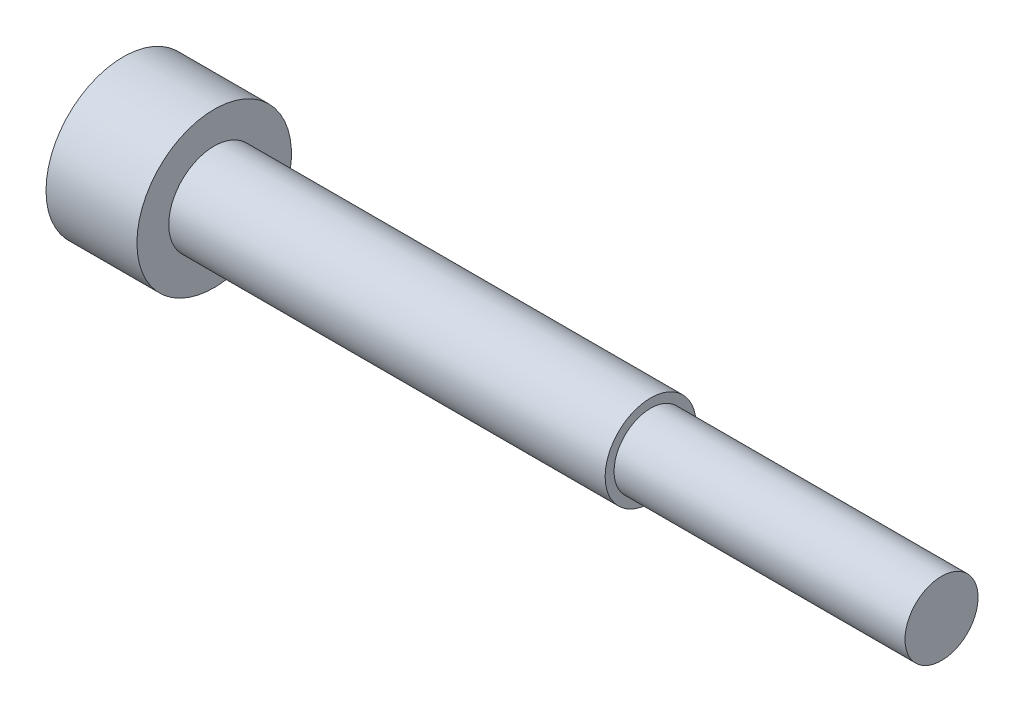
ISO-10303-21;
HEADER;
FILE_DESCRIPTION(('STEP AP214'),'2;1');
FILE_NAME('part.step','',(''),(''),'','','');
FILE_SCHEMA(('AUTOMOTIVE_DESIGN { 1 0 10303 214 1 1 1 1 }'));
ENDSEC;
DATA;
#1=APPLICATION_CONTEXT('core data for automotive mechanical design processes');
#2=APPLICATION_PROTOCOL_DEFINITION('international standard','automotive_design',2000,#1);
#3=PRODUCT_CONTEXT('',#1,'mechanical');
#4=PRODUCT('Part','Part','',(#3));
#5=PRODUCT_RELATED_PRODUCT_CATEGORY('part','',(#4));
#6=PRODUCT_DEFINITION_FORMATION('','',#4);
#7=PRODUCT_DEFINITION_CONTEXT('part definition',#1,'design');
#8=PRODUCT_DEFINITION('design','',#6,#7);
#9=PRODUCT_DEFINITION_SHAPE('','',#8);
#10=(LENGTH_UNIT() NAMED_UNIT(*) SI_UNIT(.MILLI.,.METRE.));
#11=(NAMED_UNIT(*) PLANE_ANGLE_UNIT() SI_UNIT($,.RADIAN.));
#12=(NAMED_UNIT(*) SI_UNIT($,.STERADIAN.) SOLID_ANGLE_UNIT());
#13=UNCERTAINTY_MEASURE_WITH_UNIT(LENGTH_MEASURE(1.E-05),#10,'distance_accuracy_value','');
#14=(GEOMETRIC_REPRESENTATION_CONTEXT(3) GLOBAL_UNCERTAINTY_ASSIGNED_CONTEXT((#13)) GLOBAL_UNIT_ASSIGNED_CONTEXT((#10,
#11,#12)) REPRESENTATION_CONTEXT('',''));
#15=CARTESIAN_POINT('',(0.,0.,0.));
#16=DIRECTION('',(0.,0.,1.));
#17=DIRECTION('',(1.,0.,0.));
#18=AXIS2_PLACEMENT_3D('',#15,#16,#17);
#19=CARTESIAN_POINT('',(0.,2.0095,0.));
#20=DIRECTION('',(-1.,0.,0.));
#21=DIRECTION('',(0.,0.,1.));
#22=AXIS2_PLACEMENT_3D('',#19,#20,#21);
#23=PLANE('',#22);
#24=CARTESIAN_POINT('',(0.,0.,0.));
#25=DIRECTION('',(-1.,0.,0.));
#26=DIRECTION('',(0.,0.,1.));
#27=AXIS2_PLACEMENT_3D('',#24,#25,#26);
#28=CIRCLE('',#27,4.25);
#29=CARTESIAN_POINT('',(0.,0.,4.25));
#30=VERTEX_POINT('',#29);
#31=EDGE_CURVE('E143',#30,#30,#28,.T.);
#32=ORIENTED_EDGE('',*,*,#31,.F.);
#33=EDGE_LOOP('',(#32));
#34=FACE_BOUND('',#33,.T.);
#35=CARTESIAN_POINT('',(0.,0.,0.));
#36=DIRECTION('',(-1.,0.,0.));
#37=DIRECTION('',(0.,0.,1.));
#38=AXIS2_PLACEMENT_3D('',#35,#36,#37);
#39=CIRCLE('',#38,2.5);
#40=CARTESIAN_POINT('',(0.,0.,2.5));
#41=VERTEX_POINT('',#40);
#42=EDGE_CURVE('E39',#41,#41,#39,.F.);
#43=ORIENTED_EDGE('',*,*,#42,.F.);
#44=EDGE_LOOP('',(#43));
#45=FACE_BOUND('',#44,.T.);
#46=ADVANCED_FACE('F31',(#34,#45),#23,.F.);
#47=CARTESIAN_POINT('',(0.,0.,0.));
#48=DIRECTION('',(-1.,0.,0.));
#49=DIRECTION('',(0.,0.,1.));
#50=AXIS2_PLACEMENT_3D('',#47,#48,#49);
#51=CYLINDRICAL_SURFACE('',#50,4.25);
#52=CARTESIAN_POINT('',(-5.,0.,0.));
#53=DIRECTION('',(-1.,0.,0.));
#54=DIRECTION('',(0.,0.,1.));
#55=AXIS2_PLACEMENT_3D('',#52,#53,#54);
#56=CIRCLE('',#55,4.25);
#57=CARTESIAN_POINT('',(-5.,0.,4.25));
#58=VERTEX_POINT('',#57);
#59=EDGE_CURVE('E134',#58,#58,#56,.T.);
#60=ORIENTED_EDGE('',*,*,#59,.F.);
#61=EDGE_LOOP('',(#60));
#62=FACE_BOUND('',#61,.T.);
#63=ORIENTED_EDGE('',*,*,#31,.T.);
#64=EDGE_LOOP('',(#63));
#65=FACE_BOUND('',#64,.T.);
#66=ADVANCED_FACE('F154',(#62,#65),#51,.T.);
#67=CARTESIAN_POINT('',(-5.,4.25,0.));
#68=DIRECTION('',(1.,0.,0.));
#69=DIRECTION('',(0.,0.,-1.));
#70=AXIS2_PLACEMENT_3D('',#67,#68,#69);
#71=PLANE('',#70);
#72=DIRECTION('',(0.,0.866025403784439,-0.5));
#73=VECTOR('',#72,1.);
#74=CARTESIAN_POINT('',(-5.,0.,2.3094010767585));
#75=LINE('',#74,#73);
#76=CARTESIAN_POINT('',(-5.,0.,2.3094010767585));
#77=VERTEX_POINT('',#76);
#78=CARTESIAN_POINT('',(-5.,2.,1.15470053837925));
#79=VERTEX_POINT('',#78);
#80=EDGE_CURVE('E100',#77,#79,#75,.T.);
#81=ORIENTED_EDGE('',*,*,#80,.F.);
#82=DIRECTION('',(0.,0.866025403784439,0.5));
#83=VECTOR('',#82,1.);
#84=CARTESIAN_POINT('',(-5.,-2.,1.15470053837925));
#85=LINE('',#84,#83);
#86=CARTESIAN_POINT('',(-5.,-2.,1.15470053837925));
#87=VERTEX_POINT('',#86);
#88=EDGE_CURVE('E46',#87,#77,#85,.T.);
#89=ORIENTED_EDGE('',*,*,#88,.F.);
#90=DIRECTION('',(0.,0.,1.));
#91=VECTOR('',#90,1.);
#92=CARTESIAN_POINT('',(-5.,-2.,-1.15470053837925));
#93=LINE('',#92,#91);
#94=CARTESIAN_POINT('',(-5.,-2.,-1.15470053837925));
#95=VERTEX_POINT('',#94);
#96=EDGE_CURVE('E116',#95,#87,#93,.T.);
#97=ORIENTED_EDGE('',*,*,#96,.F.);
#98=DIRECTION('',(0.,-0.866025403784439,0.5));
#99=VECTOR('',#98,1.);
#100=CARTESIAN_POINT('',(-5.,0.,-2.3094010767585));
#101=LINE('',#100,#99);
#102=CARTESIAN_POINT('',(-5.,0.,-2.3094010767585));
#103=VERTEX_POINT('',#102);
#104=EDGE_CURVE('E110',#103,#95,#101,.T.);
#105=ORIENTED_EDGE('',*,*,#104,.F.);
#106=DIRECTION('',(0.,-0.866025403784439,-0.5));
#107=VECTOR('',#106,1.);
#108=CARTESIAN_POINT('',(-5.,2.,-1.15470053837925));
#109=LINE('',#108,#107);
#110=CARTESIAN_POINT('',(-5.,2.,-1.15470053837925));
#111=VERTEX_POINT('',#110);
#112=EDGE_CURVE('E108',#111,#103,#109,.T.);
#113=ORIENTED_EDGE('',*,*,#112,.F.);
#114=DIRECTION('',(0.,0.,-1.));
#115=VECTOR('',#114,1.);
#116=CARTESIAN_POINT('',(-5.,2.,1.15470053837925));
#117=LINE('',#116,#115);
#118=EDGE_CURVE('E89',#79,#111,#117,.T.);
#119=ORIENTED_EDGE('',*,*,#118,.F.);
#120=EDGE_LOOP('',(#81,#89,#97,#105,#113,#119));
#121=FACE_BOUND('',#120,.T.);
#122=ORIENTED_EDGE('',*,*,#59,.T.);
#123=EDGE_LOOP('',(#122));
#124=FACE_BOUND('',#123,.T.);
#125=ADVANCED_FACE('F104',(#121,#124),#71,.F.);
#126=CARTESIAN_POINT('',(-1.35,-2.,1.15470053837925));
#127=DIRECTION('',(0.,-0.5,0.866025403784439));
#128=DIRECTION('',(0.,-0.866025403784439,-0.5));
#129=AXIS2_PLACEMENT_3D('',#126,#127,#128);
#130=PLANE('',#129);
#131=ORIENTED_EDGE('',*,*,#88,.T.);
#132=DIRECTION('',(-1.,0.,0.));
#133=VECTOR('',#132,1.);
#134=CARTESIAN_POINT('',(-1.35,0.,2.3094010767585));
#135=LINE('',#134,#133);
#136=CARTESIAN_POINT('',(-1.35,0.,2.3094010767585));
#137=VERTEX_POINT('',#136);
#138=EDGE_CURVE('E97',#137,#77,#135,.T.);
#139=ORIENTED_EDGE('',*,*,#138,.F.);
#140=DIRECTION('',(0.,0.866025403784439,0.5));
#141=VECTOR('',#140,1.);
#142=CARTESIAN_POINT('',(-1.35,-2.,1.15470053837925));
#143=LINE('',#142,#141);
#144=CARTESIAN_POINT('',(-1.35,-2.,1.15470053837925));
#145=VERTEX_POINT('',#144);
#146=EDGE_CURVE('E118',#145,#137,#143,.T.);
#147=ORIENTED_EDGE('',*,*,#146,.F.);
#148=DIRECTION('',(-1.,0.,0.));
#149=VECTOR('',#148,1.);
#150=CARTESIAN_POINT('',(-1.35,-2.,1.15470053837925));
#151=LINE('',#150,#149);
#152=EDGE_CURVE('E53',#145,#87,#151,.T.);
#153=ORIENTED_EDGE('',*,*,#152,.T.);
#154=EDGE_LOOP('',(#131,#139,#147,#153));
#155=FACE_BOUND('',#154,.T.);
#156=ADVANCED_FACE('F194',(#155),#130,.F.);
#157=CARTESIAN_POINT('',(-1.35,-2.,-1.15470053837925));
#158=DIRECTION('',(0.,-1.,0.));
#159=DIRECTION('',(0.,0.,-1.));
#160=AXIS2_PLACEMENT_3D('',#157,#158,#159);
#161=PLANE('',#160);
#162=ORIENTED_EDGE('',*,*,#96,.T.);
#163=ORIENTED_EDGE('',*,*,#152,.F.);
#164=DIRECTION('',(0.,0.,1.));
#165=VECTOR('',#164,1.);
#166=CARTESIAN_POINT('',(-1.35,-2.,-1.15470053837925));
#167=LINE('',#166,#165);
#168=CARTESIAN_POINT('',(-1.35,-2.,-1.15470053837925));
#169=VERTEX_POINT('',#168);
#170=EDGE_CURVE('E130',#169,#145,#167,.T.);
#171=ORIENTED_EDGE('',*,*,#170,.F.);
#172=DIRECTION('',(-1.,0.,0.));
#173=VECTOR('',#172,1.);
#174=CARTESIAN_POINT('',(-1.35,-2.,-1.15470053837925));
#175=LINE('',#174,#173);
#176=EDGE_CURVE('E135',#169,#95,#175,.T.);
#177=ORIENTED_EDGE('',*,*,#176,.T.);
#178=EDGE_LOOP('',(#162,#163,#171,#177));
#179=FACE_BOUND('',#178,.T.);
#180=ADVANCED_FACE('F190',(#179),#161,.F.);
#181=CARTESIAN_POINT('',(-1.35,0.,-2.3094010767585));
#182=DIRECTION('',(0.,-0.5,-0.866025403784439));
#183=DIRECTION('',(0.,0.866025403784439,-0.5));
#184=AXIS2_PLACEMENT_3D('',#181,#182,#183);
#185=PLANE('',#184);
#186=ORIENTED_EDGE('',*,*,#104,.T.);
#187=ORIENTED_EDGE('',*,*,#176,.F.);
#188=DIRECTION('',(0.,-0.866025403784439,0.5));
#189=VECTOR('',#188,1.);
#190=CARTESIAN_POINT('',(-1.35,0.,-2.3094010767585));
#191=LINE('',#190,#189);
#192=CARTESIAN_POINT('',(-1.35,0.,-2.3094010767585));
#193=VERTEX_POINT('',#192);
#194=EDGE_CURVE('E127',#193,#169,#191,.T.);
#195=ORIENTED_EDGE('',*,*,#194,.F.);
#196=DIRECTION('',(-1.,0.,0.));
#197=VECTOR('',#196,1.);
#198=CARTESIAN_POINT('',(-1.35,0.,-2.3094010767585));
#199=LINE('',#198,#197);
#200=EDGE_CURVE('E137',#193,#103,#199,.T.);
#201=ORIENTED_EDGE('',*,*,#200,.T.);
#202=EDGE_LOOP('',(#186,#187,#195,#201));
#203=FACE_BOUND('',#202,.T.);
#204=ADVANCED_FACE('F193',(#203),#185,.F.);
#205=CARTESIAN_POINT('',(-1.35,2.,-1.15470053837925));
#206=DIRECTION('',(0.,0.5,-0.866025403784439));
#207=DIRECTION('',(0.,0.866025403784439,0.5));
#208=AXIS2_PLACEMENT_3D('',#205,#206,#207);
#209=PLANE('',#208);
#210=ORIENTED_EDGE('',*,*,#112,.T.);
#211=ORIENTED_EDGE('',*,*,#200,.F.);
#212=DIRECTION('',(0.,-0.866025403784439,-0.5));
#213=VECTOR('',#212,1.);
#214=CARTESIAN_POINT('',(-1.35,2.,-1.15470053837925));
#215=LINE('',#214,#213);
#216=CARTESIAN_POINT('',(-1.35,2.,-1.15470053837925));
#217=VERTEX_POINT('',#216);
#218=EDGE_CURVE('E124',#217,#193,#215,.T.);
#219=ORIENTED_EDGE('',*,*,#218,.F.);
#220=DIRECTION('',(-1.,0.,0.));
#221=VECTOR('',#220,1.);
#222=CARTESIAN_POINT('',(-1.35,2.,-1.15470053837925));
#223=LINE('',#222,#221);
#224=EDGE_CURVE('E96',#217,#111,#223,.T.);
#225=ORIENTED_EDGE('',*,*,#224,.T.);
#226=EDGE_LOOP('',(#210,#211,#219,#225));
#227=FACE_BOUND('',#226,.T.);
#228=ADVANCED_FACE('F197',(#227),#209,.F.);
#229=CARTESIAN_POINT('',(-1.35,2.,1.15470053837925));
#230=DIRECTION('',(0.,1.,0.));
#231=DIRECTION('',(0.,0.,1.));
#232=AXIS2_PLACEMENT_3D('',#229,#230,#231);
#233=PLANE('',#232);
#234=ORIENTED_EDGE('',*,*,#118,.T.);
#235=ORIENTED_EDGE('',*,*,#224,.F.);
#236=DIRECTION('',(0.,0.,-1.));
#237=VECTOR('',#236,1.);
#238=CARTESIAN_POINT('',(-1.35,2.,1.15470053837925));
#239=LINE('',#238,#237);
#240=CARTESIAN_POINT('',(-1.35,2.,1.15470053837925));
#241=VERTEX_POINT('',#240);
#242=EDGE_CURVE('E92',#241,#217,#239,.T.);
#243=ORIENTED_EDGE('',*,*,#242,.F.);
#244=DIRECTION('',(-1.,0.,0.));
#245=VECTOR('',#244,1.);
#246=CARTESIAN_POINT('',(-1.35,2.,1.15470053837925));
#247=LINE('',#246,#245);
#248=EDGE_CURVE('E85',#241,#79,#247,.T.);
#249=ORIENTED_EDGE('',*,*,#248,.T.);
#250=EDGE_LOOP('',(#234,#235,#243,#249));
#251=FACE_BOUND('',#250,.T.);
#252=ADVANCED_FACE('F87',(#251),#233,.F.);
#253=CARTESIAN_POINT('',(-1.35,0.,2.3094010767585));
#254=DIRECTION('',(0.,0.5,0.866025403784439));
#255=DIRECTION('',(0.,-0.866025403784439,0.5));
#256=AXIS2_PLACEMENT_3D('',#253,#254,#255);
#257=PLANE('',#256);
#258=ORIENTED_EDGE('',*,*,#80,.T.);
#259=ORIENTED_EDGE('',*,*,#248,.F.);
#260=DIRECTION('',(0.,0.866025403784439,-0.5));
#261=VECTOR('',#260,1.);
#262=CARTESIAN_POINT('',(-1.35,0.,2.3094010767585));
#263=LINE('',#262,#261);
#264=EDGE_CURVE('E121',#137,#241,#263,.T.);
#265=ORIENTED_EDGE('',*,*,#264,.F.);
#266=ORIENTED_EDGE('',*,*,#138,.T.);
#267=EDGE_LOOP('',(#258,#259,#265,#266));
#268=FACE_BOUND('',#267,.T.);
#269=ADVANCED_FACE('F101',(#268),#257,.F.);
#270=CARTESIAN_POINT('',(-1.35,-2.,1.15470053837925));
#271=DIRECTION('',(1.,0.,0.));
#272=DIRECTION('',(0.,0.,-1.));
#273=AXIS2_PLACEMENT_3D('',#270,#271,#272);
#274=PLANE('',#273);
#275=ORIENTED_EDGE('',*,*,#146,.T.);
#276=ORIENTED_EDGE('',*,*,#264,.T.);
#277=ORIENTED_EDGE('',*,*,#242,.T.);
#278=ORIENTED_EDGE('',*,*,#218,.T.);
#279=ORIENTED_EDGE('',*,*,#194,.T.);
#280=ORIENTED_EDGE('',*,*,#170,.T.);
#281=EDGE_LOOP('',(#275,#276,#277,#278,#279,#280));
#282=FACE_BOUND('',#281,.T.);
#283=ADVANCED_FACE('F179',(#282),#274,.F.);
#284=CARTESIAN_POINT('',(24.,0.,0.));
#285=DIRECTION('',(-1.,0.,0.));
#286=DIRECTION('',(0.,0.,1.));
#287=AXIS2_PLACEMENT_3D('',#284,#285,#286);
#288=PLANE('',#287);
#289=CARTESIAN_POINT('',(24.,0.,0.));
#290=DIRECTION('',(-1.,0.,0.));
#291=DIRECTION('',(0.,0.,1.));
#292=AXIS2_PLACEMENT_3D('',#289,#290,#291);
#293=CIRCLE('',#292,2.5);
#294=CARTESIAN_POINT('',(24.,0.,2.5));
#295=VERTEX_POINT('',#294);
#296=EDGE_CURVE('E261',#295,#295,#293,.T.);
#297=ORIENTED_EDGE('',*,*,#296,.F.);
#298=EDGE_LOOP('',(#297));
#299=FACE_BOUND('',#298,.T.);
#300=CARTESIAN_POINT('',(24.,0.,0.));
#301=DIRECTION('',(-1.,0.,0.));
#302=DIRECTION('',(0.,0.,1.));
#303=AXIS2_PLACEMENT_3D('',#300,#301,#302);
#304=CIRCLE('',#303,2.0095);
#305=CARTESIAN_POINT('',(24.,0.,2.0095));
#306=VERTEX_POINT('',#305);
#307=EDGE_CURVE('E12',#306,#306,#304,.T.);
#308=ORIENTED_EDGE('',*,*,#307,.T.);
#309=EDGE_LOOP('',(#308));
#310=FACE_BOUND('',#309,.T.);
#311=ADVANCED_FACE('F178',(#299,#310),#288,.F.);
#312=CARTESIAN_POINT('',(47.0710678118655,0.,0.));
#313=DIRECTION('',(-1.,0.,0.));
#314=DIRECTION('',(0.,0.,1.));
#315=AXIS2_PLACEMENT_3D('',#312,#313,#314);
#316=CYLINDRICAL_SURFACE('',#315,2.5);
#317=ORIENTED_EDGE('',*,*,#296,.T.);
#318=EDGE_LOOP('',(#317));
#319=FACE_BOUND('',#318,.T.);
#320=ORIENTED_EDGE('',*,*,#42,.T.);
#321=EDGE_LOOP('',(#320));
#322=FACE_BOUND('',#321,.T.);
#323=ADVANCED_FACE('F151',(#319,#322),#316,.T.);
#324=CARTESIAN_POINT('',(40.,0.,0.));
#325=DIRECTION('',(-1.,0.,0.));
#326=DIRECTION('',(0.,0.,1.));
#327=AXIS2_PLACEMENT_3D('',#324,#325,#326);
#328=PLANE('',#327);
#329=CARTESIAN_POINT('',(40.,0.,0.));
#330=DIRECTION('',(-1.,0.,0.));
#331=DIRECTION('',(0.,0.,1.));
#332=AXIS2_PLACEMENT_3D('',#329,#330,#331);
#333=CIRCLE('',#332,2.0095);
#334=CARTESIAN_POINT('',(40.,0.,2.0095));
#335=VERTEX_POINT('',#334);
#336=EDGE_CURVE('E146',#335,#335,#333,.T.);
#337=ORIENTED_EDGE('',*,*,#336,.F.);
#338=EDGE_LOOP('',(#337));
#339=FACE_BOUND('',#338,.T.);
#340=ADVANCED_FACE('F33',(#339),#328,.F.);
#341=CARTESIAN_POINT('',(0.,0.,0.));
#342=DIRECTION('',(-1.,0.,0.));
#343=DIRECTION('',(0.,0.,1.));
#344=AXIS2_PLACEMENT_3D('',#341,#342,#343);
#345=CYLINDRICAL_SURFACE('',#344,2.0095);
#346=ORIENTED_EDGE('',*,*,#336,.T.);
#347=EDGE_LOOP('',(#346));
#348=FACE_BOUND('',#347,.T.);
#349=ORIENTED_EDGE('',*,*,#307,.F.);
#350=EDGE_LOOP('',(#349));
#351=FACE_BOUND('',#350,.T.);
#352=ADVANCED_FACE('F166',(#348,#351),#345,.T.);
#353=CLOSED_SHELL('',(#46,#66,#125,#156,#180,#204,#228,#252,#269,#283,#311,#323,#340,#352));
#354=MANIFOLD_SOLID_BREP('B2',#353);
#355=ADVANCED_BREP_SHAPE_REPRESENTATION('',(#18,#354),#14);
#356=SHAPE_DEFINITION_REPRESENTATION(#9,#355);
ENDSEC;
END-ISO-10303-21;
